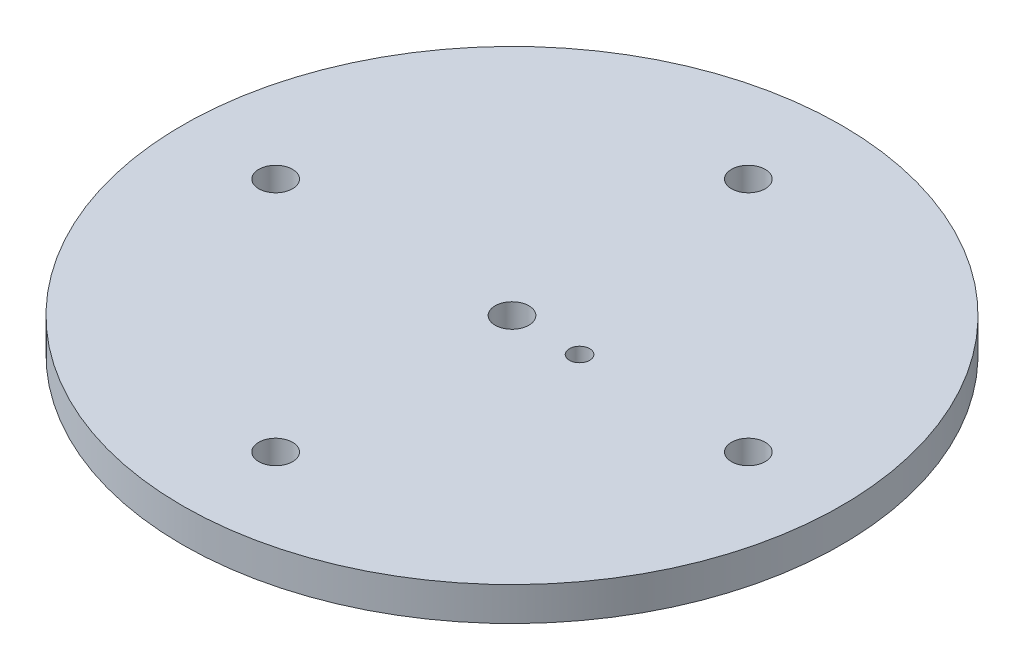
ISO-10303-21;
HEADER;
FILE_DESCRIPTION(('STEP AP214'),'2;1');
FILE_NAME('part.step','',(''),(''),'','','');
FILE_SCHEMA(('AUTOMOTIVE_DESIGN { 1 0 10303 214 1 1 1 1 }'));
ENDSEC;
DATA;
#1=APPLICATION_CONTEXT('core data for automotive mechanical design processes');
#2=APPLICATION_PROTOCOL_DEFINITION('international standard','automotive_design',2000,#1);
#3=PRODUCT_CONTEXT('',#1,'mechanical');
#4=PRODUCT('Part','Part','',(#3));
#5=PRODUCT_RELATED_PRODUCT_CATEGORY('part','',(#4));
#6=PRODUCT_DEFINITION_FORMATION('','',#4);
#7=PRODUCT_DEFINITION_CONTEXT('part definition',#1,'design');
#8=PRODUCT_DEFINITION('design','',#6,#7);
#9=PRODUCT_DEFINITION_SHAPE('','',#8);
#10=(LENGTH_UNIT() NAMED_UNIT(*) SI_UNIT(.MILLI.,.METRE.));
#11=(NAMED_UNIT(*) PLANE_ANGLE_UNIT() SI_UNIT($,.RADIAN.));
#12=(NAMED_UNIT(*) SI_UNIT($,.STERADIAN.) SOLID_ANGLE_UNIT());
#13=UNCERTAINTY_MEASURE_WITH_UNIT(LENGTH_MEASURE(1.E-05),#10,'distance_accuracy_value','');
#14=(GEOMETRIC_REPRESENTATION_CONTEXT(3) GLOBAL_UNCERTAINTY_ASSIGNED_CONTEXT((#13)) GLOBAL_UNIT_ASSIGNED_CONTEXT((#10,
#11,#12)) REPRESENTATION_CONTEXT('',''));
#15=CARTESIAN_POINT('',(0.,0.,0.));
#16=DIRECTION('',(0.,0.,1.));
#17=DIRECTION('',(1.,0.,0.));
#18=AXIS2_PLACEMENT_3D('',#15,#16,#17);
#19=CARTESIAN_POINT('',(0.,6.35,0.));
#20=DIRECTION('',(0.,-1.,0.));
#21=DIRECTION('',(0.,0.,-1.));
#22=AXIS2_PLACEMENT_3D('',#19,#20,#21);
#23=CYLINDRICAL_SURFACE('',#22,61.976);
#24=CARTESIAN_POINT('',(0.,6.35,0.));
#25=DIRECTION('',(0.,1.,0.));
#26=DIRECTION('',(0.,0.,1.));
#27=AXIS2_PLACEMENT_3D('',#24,#25,#26);
#28=CIRCLE('',#27,61.976);
#29=CARTESIAN_POINT('',(0.,6.35,61.976));
#30=VERTEX_POINT('',#29);
#31=EDGE_CURVE('E10',#30,#30,#28,.T.);
#32=ORIENTED_EDGE('',*,*,#31,.F.);
#33=EDGE_LOOP('',(#32));
#34=FACE_BOUND('',#33,.T.);
#35=CARTESIAN_POINT('',(0.,0.,0.));
#36=DIRECTION('',(0.,1.,0.));
#37=DIRECTION('',(0.,0.,1.));
#38=AXIS2_PLACEMENT_3D('',#35,#36,#37);
#39=CIRCLE('',#38,61.976);
#40=CARTESIAN_POINT('',(0.,0.,61.976));
#41=VERTEX_POINT('',#40);
#42=EDGE_CURVE('E48',#41,#41,#39,.T.);
#43=ORIENTED_EDGE('',*,*,#42,.T.);
#44=EDGE_LOOP('',(#43));
#45=FACE_BOUND('',#44,.T.);
#46=ADVANCED_FACE('F40',(#34,#45),#23,.T.);
#47=CARTESIAN_POINT('',(0.,6.35,0.));
#48=DIRECTION('',(0.,1.,0.));
#49=DIRECTION('',(0.,0.,1.));
#50=AXIS2_PLACEMENT_3D('',#47,#48,#49);
#51=PLANE('',#50);
#52=CARTESIAN_POINT('',(12.7,6.35,0.));
#53=DIRECTION('',(0.,1.,0.));
#54=DIRECTION('',(0.,0.,1.));
#55=AXIS2_PLACEMENT_3D('',#52,#53,#54);
#56=CIRCLE('',#55,1.905);
#57=CARTESIAN_POINT('',(12.7,6.35,1.905));
#58=VERTEX_POINT('',#57);
#59=EDGE_CURVE('E131',#58,#58,#56,.T.);
#60=ORIENTED_EDGE('',*,*,#59,.F.);
#61=EDGE_LOOP('',(#60));
#62=FACE_BOUND('',#61,.T.);
#63=CARTESIAN_POINT('',(0.,6.35,-44.45));
#64=DIRECTION('',(0.,1.,0.));
#65=DIRECTION('',(0.,0.,1.));
#66=AXIS2_PLACEMENT_3D('',#63,#64,#65);
#67=CIRCLE('',#66,3.17499999999999);
#68=CARTESIAN_POINT('',(0.,6.35,-41.275));
#69=VERTEX_POINT('',#68);
#70=EDGE_CURVE('E85',#69,#69,#67,.T.);
#71=ORIENTED_EDGE('',*,*,#70,.F.);
#72=EDGE_LOOP('',(#71));
#73=FACE_BOUND('',#72,.T.);
#74=CARTESIAN_POINT('',(44.45,6.35,1.55196345511577E-13));
#75=DIRECTION('',(0.,1.,0.));
#76=DIRECTION('',(0.,0.,1.));
#77=AXIS2_PLACEMENT_3D('',#74,#75,#76);
#78=CIRCLE('',#77,3.17499999999999);
#79=CARTESIAN_POINT('',(44.45,6.35,3.17500000000015));
#80=VERTEX_POINT('',#79);
#81=EDGE_CURVE('E72',#80,#80,#78,.T.);
#82=ORIENTED_EDGE('',*,*,#81,.F.);
#83=EDGE_LOOP('',(#82));
#84=FACE_BOUND('',#83,.T.);
#85=CARTESIAN_POINT('',(-3.10392691023155E-13,6.35,44.45));
#86=DIRECTION('',(0.,1.,0.));
#87=DIRECTION('',(0.,0.,1.));
#88=AXIS2_PLACEMENT_3D('',#85,#86,#87);
#89=CIRCLE('',#88,3.17499999999999);
#90=CARTESIAN_POINT('',(-3.10392691023155E-13,6.35,47.625));
#91=VERTEX_POINT('',#90);
#92=EDGE_CURVE('E68',#91,#91,#89,.T.);
#93=ORIENTED_EDGE('',*,*,#92,.F.);
#94=EDGE_LOOP('',(#93));
#95=FACE_BOUND('',#94,.T.);
#96=CARTESIAN_POINT('',(-44.45,6.35,-4.65589036534732E-13));
#97=DIRECTION('',(0.,1.,0.));
#98=DIRECTION('',(0.,0.,1.));
#99=AXIS2_PLACEMENT_3D('',#96,#97,#98);
#100=CIRCLE('',#99,3.17499999999999);
#101=CARTESIAN_POINT('',(-44.45,6.35,3.17499999999952));
#102=VERTEX_POINT('',#101);
#103=EDGE_CURVE('E64',#102,#102,#100,.T.);
#104=ORIENTED_EDGE('',*,*,#103,.F.);
#105=EDGE_LOOP('',(#104));
#106=FACE_BOUND('',#105,.T.);
#107=CARTESIAN_POINT('',(0.,6.35,0.));
#108=DIRECTION('',(0.,1.,0.));
#109=DIRECTION('',(0.,0.,1.));
#110=AXIS2_PLACEMENT_3D('',#107,#108,#109);
#111=CIRCLE('',#110,3.17499999999999);
#112=CARTESIAN_POINT('',(0.,6.35,3.17499999999999));
#113=VERTEX_POINT('',#112);
#114=EDGE_CURVE('E63',#113,#113,#111,.T.);
#115=ORIENTED_EDGE('',*,*,#114,.F.);
#116=EDGE_LOOP('',(#115));
#117=FACE_BOUND('',#116,.T.);
#118=ORIENTED_EDGE('',*,*,#31,.T.);
#119=EDGE_LOOP('',(#118));
#120=FACE_BOUND('',#119,.T.);
#121=ADVANCED_FACE('F114',(#62,#73,#84,#95,#106,#117,#120),#51,.T.);
#122=CARTESIAN_POINT('',(0.,0.,0.));
#123=DIRECTION('',(0.,1.,0.));
#124=DIRECTION('',(0.,0.,1.));
#125=AXIS2_PLACEMENT_3D('',#122,#123,#124);
#126=PLANE('',#125);
#127=CARTESIAN_POINT('',(12.7,0.,0.));
#128=DIRECTION('',(0.,1.,0.));
#129=DIRECTION('',(0.,0.,1.));
#130=AXIS2_PLACEMENT_3D('',#127,#128,#129);
#131=CIRCLE('',#130,1.905);
#132=CARTESIAN_POINT('',(12.7,0.,1.905));
#133=VERTEX_POINT('',#132);
#134=EDGE_CURVE('E167',#133,#133,#131,.T.);
#135=ORIENTED_EDGE('',*,*,#134,.T.);
#136=EDGE_LOOP('',(#135));
#137=FACE_BOUND('',#136,.T.);
#138=CARTESIAN_POINT('',(0.,0.,-44.45));
#139=DIRECTION('',(0.,1.,0.));
#140=DIRECTION('',(0.,0.,1.));
#141=AXIS2_PLACEMENT_3D('',#138,#139,#140);
#142=CIRCLE('',#141,3.17499999999999);
#143=CARTESIAN_POINT('',(0.,0.,-41.275));
#144=VERTEX_POINT('',#143);
#145=EDGE_CURVE('E43',#144,#144,#142,.T.);
#146=ORIENTED_EDGE('',*,*,#145,.T.);
#147=EDGE_LOOP('',(#146));
#148=FACE_BOUND('',#147,.T.);
#149=CARTESIAN_POINT('',(44.45,0.,1.55196345511577E-13));
#150=DIRECTION('',(0.,1.,0.));
#151=DIRECTION('',(0.,0.,1.));
#152=AXIS2_PLACEMENT_3D('',#149,#150,#151);
#153=CIRCLE('',#152,3.17499999999999);
#154=CARTESIAN_POINT('',(44.45,0.,3.17500000000014));
#155=VERTEX_POINT('',#154);
#156=EDGE_CURVE('E69',#155,#155,#153,.T.);
#157=ORIENTED_EDGE('',*,*,#156,.T.);
#158=EDGE_LOOP('',(#157));
#159=FACE_BOUND('',#158,.T.);
#160=CARTESIAN_POINT('',(-3.10392691023155E-13,0.,44.45));
#161=DIRECTION('',(0.,1.,0.));
#162=DIRECTION('',(0.,0.,1.));
#163=AXIS2_PLACEMENT_3D('',#160,#161,#162);
#164=CIRCLE('',#163,3.17499999999999);
#165=CARTESIAN_POINT('',(-3.10392691023155E-13,0.,47.625));
#166=VERTEX_POINT('',#165);
#167=EDGE_CURVE('E65',#166,#166,#164,.T.);
#168=ORIENTED_EDGE('',*,*,#167,.T.);
#169=EDGE_LOOP('',(#168));
#170=FACE_BOUND('',#169,.T.);
#171=CARTESIAN_POINT('',(-44.45,0.,-4.65589036534732E-13));
#172=DIRECTION('',(0.,1.,0.));
#173=DIRECTION('',(0.,0.,1.));
#174=AXIS2_PLACEMENT_3D('',#171,#172,#173);
#175=CIRCLE('',#174,3.17499999999999);
#176=CARTESIAN_POINT('',(-44.45,0.,3.17499999999952));
#177=VERTEX_POINT('',#176);
#178=EDGE_CURVE('E59',#177,#177,#175,.T.);
#179=ORIENTED_EDGE('',*,*,#178,.T.);
#180=EDGE_LOOP('',(#179));
#181=FACE_BOUND('',#180,.T.);
#182=CARTESIAN_POINT('',(0.,0.,0.));
#183=DIRECTION('',(0.,1.,0.));
#184=DIRECTION('',(0.,0.,1.));
#185=AXIS2_PLACEMENT_3D('',#182,#183,#184);
#186=CIRCLE('',#185,3.17499999999999);
#187=CARTESIAN_POINT('',(0.,0.,3.17499999999999));
#188=VERTEX_POINT('',#187);
#189=EDGE_CURVE('E54',#188,#188,#186,.T.);
#190=ORIENTED_EDGE('',*,*,#189,.T.);
#191=EDGE_LOOP('',(#190));
#192=FACE_BOUND('',#191,.T.);
#193=ORIENTED_EDGE('',*,*,#42,.F.);
#194=EDGE_LOOP('',(#193));
#195=FACE_BOUND('',#194,.T.);
#196=ADVANCED_FACE('F99',(#137,#148,#159,#170,#181,#192,#195),#126,.F.);
#197=CARTESIAN_POINT('',(0.,6.35,0.));
#198=DIRECTION('',(0.,1.,0.));
#199=DIRECTION('',(0.,0.,1.));
#200=AXIS2_PLACEMENT_3D('',#197,#198,#199);
#201=CYLINDRICAL_SURFACE('',#200,3.17499999999999);
#202=ORIENTED_EDGE('',*,*,#114,.T.);
#203=EDGE_LOOP('',(#202));
#204=FACE_BOUND('',#203,.T.);
#205=ORIENTED_EDGE('',*,*,#189,.F.);
#206=EDGE_LOOP('',(#205));
#207=FACE_BOUND('',#206,.T.);
#208=ADVANCED_FACE('F102',(#204,#207),#201,.F.);
#209=CARTESIAN_POINT('',(-44.45,6.35,-4.65589036534732E-13));
#210=DIRECTION('',(0.,1.,0.));
#211=DIRECTION('',(0.,0.,1.));
#212=AXIS2_PLACEMENT_3D('',#209,#210,#211);
#213=CYLINDRICAL_SURFACE('',#212,3.17499999999999);
#214=ORIENTED_EDGE('',*,*,#103,.T.);
#215=EDGE_LOOP('',(#214));
#216=FACE_BOUND('',#215,.T.);
#217=ORIENTED_EDGE('',*,*,#178,.F.);
#218=EDGE_LOOP('',(#217));
#219=FACE_BOUND('',#218,.T.);
#220=ADVANCED_FACE('F104',(#216,#219),#213,.F.);
#221=CARTESIAN_POINT('',(-3.10392691023155E-13,6.35,44.45));
#222=DIRECTION('',(0.,1.,0.));
#223=DIRECTION('',(0.,0.,1.));
#224=AXIS2_PLACEMENT_3D('',#221,#222,#223);
#225=CYLINDRICAL_SURFACE('',#224,3.17499999999999);
#226=ORIENTED_EDGE('',*,*,#92,.T.);
#227=EDGE_LOOP('',(#226));
#228=FACE_BOUND('',#227,.T.);
#229=ORIENTED_EDGE('',*,*,#167,.F.);
#230=EDGE_LOOP('',(#229));
#231=FACE_BOUND('',#230,.T.);
#232=ADVANCED_FACE('F110',(#228,#231),#225,.F.);
#233=CARTESIAN_POINT('',(44.45,6.35,1.55196345511577E-13));
#234=DIRECTION('',(0.,1.,0.));
#235=DIRECTION('',(0.,0.,1.));
#236=AXIS2_PLACEMENT_3D('',#233,#234,#235);
#237=CYLINDRICAL_SURFACE('',#236,3.17499999999999);
#238=ORIENTED_EDGE('',*,*,#81,.T.);
#239=EDGE_LOOP('',(#238));
#240=FACE_BOUND('',#239,.T.);
#241=ORIENTED_EDGE('',*,*,#156,.F.);
#242=EDGE_LOOP('',(#241));
#243=FACE_BOUND('',#242,.T.);
#244=ADVANCED_FACE('F146',(#240,#243),#237,.F.);
#245=CARTESIAN_POINT('',(0.,6.35,-44.45));
#246=DIRECTION('',(0.,1.,0.));
#247=DIRECTION('',(0.,0.,1.));
#248=AXIS2_PLACEMENT_3D('',#245,#246,#247);
#249=CYLINDRICAL_SURFACE('',#248,3.17499999999999);
#250=ORIENTED_EDGE('',*,*,#70,.T.);
#251=EDGE_LOOP('',(#250));
#252=FACE_BOUND('',#251,.T.);
#253=ORIENTED_EDGE('',*,*,#145,.F.);
#254=EDGE_LOOP('',(#253));
#255=FACE_BOUND('',#254,.T.);
#256=ADVANCED_FACE('F153',(#252,#255),#249,.F.);
#257=CARTESIAN_POINT('',(12.7,0.,0.));
#258=DIRECTION('',(0.,1.,0.));
#259=DIRECTION('',(0.,0.,1.));
#260=AXIS2_PLACEMENT_3D('',#257,#258,#259);
#261=CYLINDRICAL_SURFACE('',#260,1.905);
#262=ORIENTED_EDGE('',*,*,#134,.F.);
#263=EDGE_LOOP('',(#262));
#264=FACE_BOUND('',#263,.T.);
#265=ORIENTED_EDGE('',*,*,#59,.T.);
#266=EDGE_LOOP('',(#265));
#267=FACE_BOUND('',#266,.T.);
#268=ADVANCED_FACE('F158',(#264,#267),#261,.F.);
#269=CLOSED_SHELL('',(#46,#121,#196,#208,#220,#232,#244,#256,#268));
#270=MANIFOLD_SOLID_BREP('B2',#269);
#271=ADVANCED_BREP_SHAPE_REPRESENTATION('',(#18,#270),#14);
#272=SHAPE_DEFINITION_REPRESENTATION(#9,#271);
ENDSEC;
END-ISO-10303-21;
